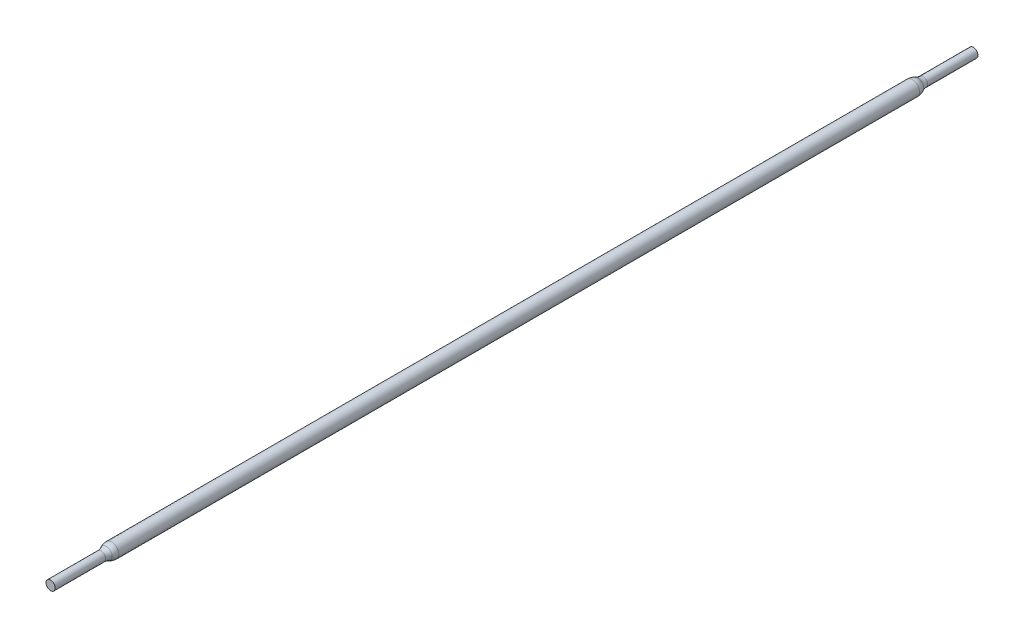
ISO-10303-21;
HEADER;
FILE_DESCRIPTION(('STEP AP214'),'2;1');
FILE_NAME('part.step','',(''),(''),'','','');
FILE_SCHEMA(('AUTOMOTIVE_DESIGN { 1 0 10303 214 1 1 1 1 }'));
ENDSEC;
DATA;
#1=APPLICATION_CONTEXT('core data for automotive mechanical design processes');
#2=APPLICATION_PROTOCOL_DEFINITION('international standard','automotive_design',2000,#1);
#3=PRODUCT_CONTEXT('',#1,'mechanical');
#4=PRODUCT('Part','Part','',(#3));
#5=PRODUCT_RELATED_PRODUCT_CATEGORY('part','',(#4));
#6=PRODUCT_DEFINITION_FORMATION('','',#4);
#7=PRODUCT_DEFINITION_CONTEXT('part definition',#1,'design');
#8=PRODUCT_DEFINITION('design','',#6,#7);
#9=PRODUCT_DEFINITION_SHAPE('','',#8);
#10=(LENGTH_UNIT() NAMED_UNIT(*) SI_UNIT(.MILLI.,.METRE.));
#11=(NAMED_UNIT(*) PLANE_ANGLE_UNIT() SI_UNIT($,.RADIAN.));
#12=(NAMED_UNIT(*) SI_UNIT($,.STERADIAN.) SOLID_ANGLE_UNIT());
#13=UNCERTAINTY_MEASURE_WITH_UNIT(LENGTH_MEASURE(1.E-05),#10,'distance_accuracy_value','');
#14=(GEOMETRIC_REPRESENTATION_CONTEXT(3) GLOBAL_UNCERTAINTY_ASSIGNED_CONTEXT((#13)) GLOBAL_UNIT_ASSIGNED_CONTEXT((#10,
#11,#12)) REPRESENTATION_CONTEXT('',''));
#15=CARTESIAN_POINT('',(0.,0.,0.));
#16=DIRECTION('',(0.,0.,1.));
#17=DIRECTION('',(1.,0.,0.));
#18=AXIS2_PLACEMENT_3D('',#15,#16,#17);
#19=CARTESIAN_POINT('',(0.,0.,50.));
#20=DIRECTION('',(0.,0.,-1.));
#21=DIRECTION('',(-1.,0.,0.));
#22=AXIS2_PLACEMENT_3D('',#19,#20,#21);
#23=CYLINDRICAL_SURFACE('',#22,4.);
#24=CARTESIAN_POINT('',(0.,0.,43.6803876701178));
#25=DIRECTION('',(0.,0.,1.));
#26=DIRECTION('',(1.,0.,0.));
#27=AXIS2_PLACEMENT_3D('',#24,#25,#26);
#28=CIRCLE('',#27,4.);
#29=CARTESIAN_POINT('',(4.,0.,43.6803876701178));
#30=VERTEX_POINT('',#29);
#31=EDGE_CURVE('E69',#30,#30,#28,.F.);
#32=ORIENTED_EDGE('',*,*,#31,.T.);
#33=EDGE_LOOP('',(#32));
#34=FACE_BOUND('',#33,.T.);
#35=CARTESIAN_POINT('',(0.,0.,0.));
#36=DIRECTION('',(0.,0.,1.));
#37=DIRECTION('',(1.,0.,0.));
#38=AXIS2_PLACEMENT_3D('',#35,#36,#37);
#39=CIRCLE('',#38,4.);
#40=CARTESIAN_POINT('',(4.,0.,0.));
#41=VERTEX_POINT('',#40);
#42=EDGE_CURVE('E73',#41,#41,#39,.T.);
#43=ORIENTED_EDGE('',*,*,#42,.T.);
#44=EDGE_LOOP('',(#43));
#45=FACE_BOUND('',#44,.T.);
#46=ADVANCED_FACE('F41',(#34,#45),#23,.T.);
#47=CARTESIAN_POINT('',(0.,0.,0.));
#48=DIRECTION('',(0.,0.,1.));
#49=DIRECTION('',(1.,0.,0.));
#50=AXIS2_PLACEMENT_3D('',#47,#48,#49);
#51=PLANE('',#50);
#52=ORIENTED_EDGE('',*,*,#42,.F.);
#53=EDGE_LOOP('',(#52));
#54=FACE_BOUND('',#53,.T.);
#55=ADVANCED_FACE('F95',(#54),#51,.F.);
#56=CARTESIAN_POINT('',(0.,0.,750.));
#57=DIRECTION('',(0.,0.,-1.));
#58=DIRECTION('',(-1.,0.,0.));
#59=AXIS2_PLACEMENT_3D('',#56,#57,#58);
#60=CYLINDRICAL_SURFACE('',#59,6.25);
#61=CARTESIAN_POINT('',(0.,0.,747.103458034299));
#62=DIRECTION('',(0.,0.,-1.));
#63=DIRECTION('',(-1.,0.,0.));
#64=AXIS2_PLACEMENT_3D('',#61,#62,#63);
#65=CIRCLE('',#64,6.25);
#66=CARTESIAN_POINT('',(-6.25,0.,747.103458034299));
#67=VERTEX_POINT('',#66);
#68=EDGE_CURVE('E49',#67,#67,#65,.T.);
#69=ORIENTED_EDGE('',*,*,#68,.T.);
#70=EDGE_LOOP('',(#69));
#71=FACE_BOUND('',#70,.T.);
#72=CARTESIAN_POINT('',(0.,0.,52.8965419657011));
#73=DIRECTION('',(0.,0.,-1.));
#74=DIRECTION('',(-1.,0.,0.));
#75=AXIS2_PLACEMENT_3D('',#72,#73,#74);
#76=CIRCLE('',#75,6.25);
#77=CARTESIAN_POINT('',(-6.25,0.,52.8965419657011));
#78=VERTEX_POINT('',#77);
#79=EDGE_CURVE('E54',#78,#78,#76,.F.);
#80=ORIENTED_EDGE('',*,*,#79,.T.);
#81=EDGE_LOOP('',(#80));
#82=FACE_BOUND('',#81,.T.);
#83=ADVANCED_FACE('F86',(#71,#82),#60,.T.);
#84=CARTESIAN_POINT('',(0.,0.,800.));
#85=DIRECTION('',(0.,0.,-1.));
#86=DIRECTION('',(-1.,0.,0.));
#87=AXIS2_PLACEMENT_3D('',#84,#85,#86);
#88=CYLINDRICAL_SURFACE('',#87,4.);
#89=CARTESIAN_POINT('',(0.,0.,756.319612329882));
#90=DIRECTION('',(0.,0.,-1.));
#91=DIRECTION('',(-1.,0.,0.));
#92=AXIS2_PLACEMENT_3D('',#89,#90,#91);
#93=CIRCLE('',#92,4.);
#94=CARTESIAN_POINT('',(-4.,0.,756.319612329882));
#95=VERTEX_POINT('',#94);
#96=EDGE_CURVE('E65',#95,#95,#93,.F.);
#97=ORIENTED_EDGE('',*,*,#96,.T.);
#98=EDGE_LOOP('',(#97));
#99=FACE_BOUND('',#98,.T.);
#100=CARTESIAN_POINT('',(0.,0.,800.));
#101=DIRECTION('',(0.,0.,1.));
#102=DIRECTION('',(1.,0.,0.));
#103=AXIS2_PLACEMENT_3D('',#100,#101,#102);
#104=CIRCLE('',#103,4.);
#105=CARTESIAN_POINT('',(4.,0.,800.));
#106=VERTEX_POINT('',#105);
#107=EDGE_CURVE('E77',#106,#106,#104,.T.);
#108=ORIENTED_EDGE('',*,*,#107,.F.);
#109=EDGE_LOOP('',(#108));
#110=FACE_BOUND('',#109,.T.);
#111=ADVANCED_FACE('F84',(#99,#110),#88,.T.);
#112=CARTESIAN_POINT('',(0.,0.,800.));
#113=DIRECTION('',(0.,0.,1.));
#114=DIRECTION('',(1.,0.,0.));
#115=AXIS2_PLACEMENT_3D('',#112,#113,#114);
#116=PLANE('',#115);
#117=ORIENTED_EDGE('',*,*,#107,.T.);
#118=EDGE_LOOP('',(#117));
#119=FACE_BOUND('',#118,.T.);
#120=ADVANCED_FACE('F82',(#119),#116,.T.);
#121=CARTESIAN_POINT('',(0.,0.,43.6803876701178));
#122=DIRECTION('',(0.,0.,1.));
#123=DIRECTION('',(1.,0.,0.));
#124=AXIS2_PLACEMENT_3D('',#121,#122,#123);
#125=TOROIDAL_SURFACE('',#124,14.,10.);
#126=CARTESIAN_POINT('',(0.,0.,48.2884648179095));
#127=DIRECTION('',(0.,0.,-1.));
#128=DIRECTION('',(-1.,0.,0.));
#129=AXIS2_PLACEMENT_3D('',#126,#127,#128);
#130=CIRCLE('',#129,5.125);
#131=CARTESIAN_POINT('',(-5.125,0.,48.2884648179095));
#132=VERTEX_POINT('',#131);
#133=EDGE_CURVE('E10',#132,#132,#130,.T.);
#134=ORIENTED_EDGE('',*,*,#133,.T.);
#135=EDGE_LOOP('',(#134));
#136=FACE_BOUND('',#135,.T.);
#137=ORIENTED_EDGE('',*,*,#31,.F.);
#138=EDGE_LOOP('',(#137));
#139=FACE_BOUND('',#138,.T.);
#140=ADVANCED_FACE('F93',(#136,#139),#125,.F.);
#141=CARTESIAN_POINT('',(0.,0.,756.319612329882));
#142=DIRECTION('',(0.,0.,-1.));
#143=DIRECTION('',(-1.,0.,0.));
#144=AXIS2_PLACEMENT_3D('',#141,#142,#143);
#145=TOROIDAL_SURFACE('',#144,14.,10.);
#146=CARTESIAN_POINT('',(0.,0.,751.711535182091));
#147=DIRECTION('',(0.,0.,1.));
#148=DIRECTION('',(1.,0.,0.));
#149=AXIS2_PLACEMENT_3D('',#146,#147,#148);
#150=CIRCLE('',#149,5.12499999999999);
#151=CARTESIAN_POINT('',(5.12499999999999,0.,751.711535182091));
#152=VERTEX_POINT('',#151);
#153=EDGE_CURVE('E59',#152,#152,#150,.T.);
#154=ORIENTED_EDGE('',*,*,#153,.T.);
#155=EDGE_LOOP('',(#154));
#156=FACE_BOUND('',#155,.T.);
#157=ORIENTED_EDGE('',*,*,#96,.F.);
#158=EDGE_LOOP('',(#157));
#159=FACE_BOUND('',#158,.T.);
#160=ADVANCED_FACE('F109',(#156,#159),#145,.F.);
#161=CARTESIAN_POINT('',(0.,0.,747.103458034299));
#162=DIRECTION('',(0.,0.,-1.));
#163=DIRECTION('',(-1.,0.,0.));
#164=AXIS2_PLACEMENT_3D('',#161,#162,#163);
#165=DEGENERATE_TOROIDAL_SURFACE('',#164,3.75,10.,.F.);
#166=ORIENTED_EDGE('',*,*,#68,.F.);
#167=EDGE_LOOP('',(#166));
#168=FACE_BOUND('',#167,.T.);
#169=ORIENTED_EDGE('',*,*,#153,.F.);
#170=EDGE_LOOP('',(#169));
#171=FACE_BOUND('',#170,.T.);
#172=ADVANCED_FACE('F111',(#168,#171),#165,.F.);
#173=CARTESIAN_POINT('',(0.,0.,52.8965419657011));
#174=DIRECTION('',(0.,0.,-1.));
#175=DIRECTION('',(-1.,0.,0.));
#176=AXIS2_PLACEMENT_3D('',#173,#174,#175);
#177=DEGENERATE_TOROIDAL_SURFACE('',#176,3.75,10.,.F.);
#178=ORIENTED_EDGE('',*,*,#133,.F.);
#179=EDGE_LOOP('',(#178));
#180=FACE_BOUND('',#179,.T.);
#181=ORIENTED_EDGE('',*,*,#79,.F.);
#182=EDGE_LOOP('',(#181));
#183=FACE_BOUND('',#182,.T.);
#184=ADVANCED_FACE('F43',(#180,#183),#177,.F.);
#185=CLOSED_SHELL('',(#46,#55,#83,#111,#120,#140,#160,#172,#184));
#186=MANIFOLD_SOLID_BREP('B2',#185);
#187=ADVANCED_BREP_SHAPE_REPRESENTATION('',(#18,#186),#14);
#188=SHAPE_DEFINITION_REPRESENTATION(#9,#187);
ENDSEC;
END-ISO-10303-21;
